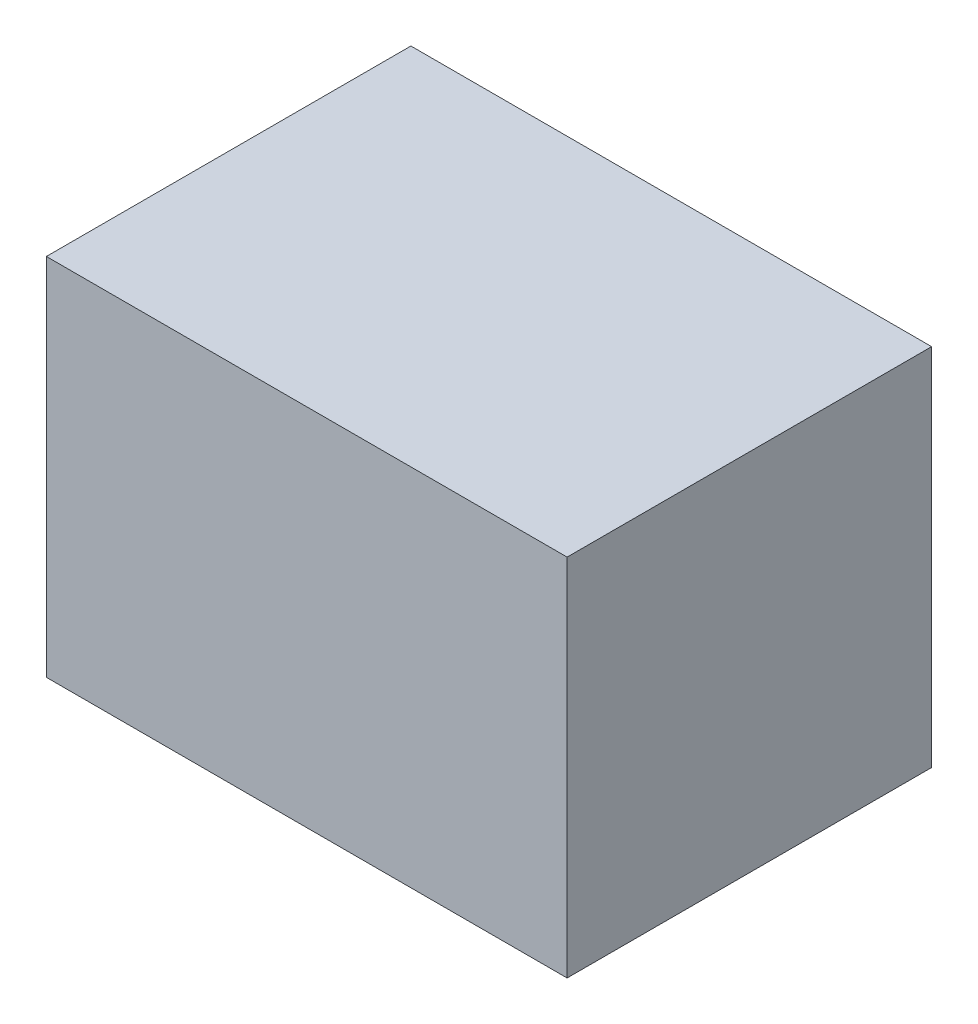
ISO-10303-21;
HEADER;
FILE_DESCRIPTION(('STEP AP214'),'2;1');
FILE_NAME('part.step','',(''),(''),'','','');
FILE_SCHEMA(('AUTOMOTIVE_DESIGN { 1 0 10303 214 1 1 1 1 }'));
ENDSEC;
DATA;
#1=APPLICATION_CONTEXT('core data for automotive mechanical design processes');
#2=APPLICATION_PROTOCOL_DEFINITION('international standard','automotive_design',2000,#1);
#3=PRODUCT_CONTEXT('',#1,'mechanical');
#4=PRODUCT('Part','Part','',(#3));
#5=PRODUCT_RELATED_PRODUCT_CATEGORY('part','',(#4));
#6=PRODUCT_DEFINITION_FORMATION('','',#4);
#7=PRODUCT_DEFINITION_CONTEXT('part definition',#1,'design');
#8=PRODUCT_DEFINITION('design','',#6,#7);
#9=PRODUCT_DEFINITION_SHAPE('','',#8);
#10=(LENGTH_UNIT() NAMED_UNIT(*) SI_UNIT(.MILLI.,.METRE.));
#11=(NAMED_UNIT(*) PLANE_ANGLE_UNIT() SI_UNIT($,.RADIAN.));
#12=(NAMED_UNIT(*) SI_UNIT($,.STERADIAN.) SOLID_ANGLE_UNIT());
#13=UNCERTAINTY_MEASURE_WITH_UNIT(LENGTH_MEASURE(1.E-05),#10,'distance_accuracy_value','');
#14=(GEOMETRIC_REPRESENTATION_CONTEXT(3) GLOBAL_UNCERTAINTY_ASSIGNED_CONTEXT((#13)) GLOBAL_UNIT_ASSIGNED_CONTEXT((#10,
#11,#12)) REPRESENTATION_CONTEXT('',''));
#15=CARTESIAN_POINT('',(0.,0.,0.));
#16=DIRECTION('',(0.,0.,1.));
#17=DIRECTION('',(1.,0.,0.));
#18=AXIS2_PLACEMENT_3D('',#15,#16,#17);
#19=CARTESIAN_POINT('',(-22.86,0.,0.));
#20=DIRECTION('',(0.,1.,0.));
#21=DIRECTION('',(1.,0.,0.));
#22=AXIS2_PLACEMENT_3D('',#19,#20,#21);
#23=PLANE('',#22);
#24=DIRECTION('',(0.,0.,1.));
#25=VECTOR('',#24,1.);
#26=CARTESIAN_POINT('',(-7.87,0.,0.749999999999982));
#27=LINE('',#26,#25);
#28=CARTESIAN_POINT('',(-7.87,0.,0.749999999999982));
#29=VERTEX_POINT('',#28);
#30=CARTESIAN_POINT('',(-7.87,0.,1.1));
#31=VERTEX_POINT('',#30);
#32=EDGE_CURVE('E79',#29,#31,#27,.T.);
#33=ORIENTED_EDGE('',*,*,#32,.T.);
#34=DIRECTION('',(1.,0.,0.));
#35=VECTOR('',#34,1.);
#36=CARTESIAN_POINT('',(-7.87,0.,1.1));
#37=LINE('',#36,#35);
#38=CARTESIAN_POINT('',(-7.37,0.,1.1));
#39=VERTEX_POINT('',#38);
#40=EDGE_CURVE('E28',#31,#39,#37,.T.);
#41=ORIENTED_EDGE('',*,*,#40,.T.);
#42=DIRECTION('',(0.,0.,1.));
#43=VECTOR('',#42,1.);
#44=CARTESIAN_POINT('',(-7.37,0.,0.749999999999982));
#45=LINE('',#44,#43);
#46=CARTESIAN_POINT('',(-7.37,0.,0.749999999999982));
#47=VERTEX_POINT('',#46);
#48=EDGE_CURVE('E100',#47,#39,#45,.T.);
#49=ORIENTED_EDGE('',*,*,#48,.F.);
#50=DIRECTION('',(1.,0.,0.));
#51=VECTOR('',#50,1.);
#52=CARTESIAN_POINT('',(-7.87,0.,0.749999999999982));
#53=LINE('',#52,#51);
#54=EDGE_CURVE('E83',#29,#47,#53,.T.);
#55=ORIENTED_EDGE('',*,*,#54,.F.);
#56=EDGE_LOOP('',(#33,#41,#49,#55));
#57=FACE_BOUND('',#56,.T.);
#58=ADVANCED_FACE('F17',(#57),#23,.T.);
#59=CARTESIAN_POINT('',(-22.86,-0.35,0.));
#60=DIRECTION('',(0.,1.,0.));
#61=DIRECTION('',(1.,0.,0.));
#62=AXIS2_PLACEMENT_3D('',#59,#60,#61);
#63=PLANE('',#62);
#64=DIRECTION('',(0.,0.,1.));
#65=VECTOR('',#64,1.);
#66=CARTESIAN_POINT('',(-7.87,-0.35,0.749999999999982));
#67=LINE('',#66,#65);
#68=CARTESIAN_POINT('',(-7.87,-0.35,0.749999999999982));
#69=VERTEX_POINT('',#68);
#70=CARTESIAN_POINT('',(-7.87,-0.35,1.1));
#71=VERTEX_POINT('',#70);
#72=EDGE_CURVE('E81',#69,#71,#67,.T.);
#73=ORIENTED_EDGE('',*,*,#72,.F.);
#74=DIRECTION('',(1.,0.,0.));
#75=VECTOR('',#74,1.);
#76=CARTESIAN_POINT('',(-7.87,-0.35,0.749999999999982));
#77=LINE('',#76,#75);
#78=CARTESIAN_POINT('',(-7.37,-0.35,0.749999999999982));
#79=VERTEX_POINT('',#78);
#80=EDGE_CURVE('E97',#69,#79,#77,.T.);
#81=ORIENTED_EDGE('',*,*,#80,.T.);
#82=DIRECTION('',(0.,0.,1.));
#83=VECTOR('',#82,1.);
#84=CARTESIAN_POINT('',(-7.37,-0.35,0.749999999999982));
#85=LINE('',#84,#83);
#86=CARTESIAN_POINT('',(-7.37,-0.35,1.1));
#87=VERTEX_POINT('',#86);
#88=EDGE_CURVE('E73',#79,#87,#85,.T.);
#89=ORIENTED_EDGE('',*,*,#88,.T.);
#90=DIRECTION('',(1.,0.,0.));
#91=VECTOR('',#90,1.);
#92=CARTESIAN_POINT('',(-7.87,-0.35,1.1));
#93=LINE('',#92,#91);
#94=EDGE_CURVE('E11',#71,#87,#93,.T.);
#95=ORIENTED_EDGE('',*,*,#94,.F.);
#96=EDGE_LOOP('',(#73,#81,#89,#95));
#97=FACE_BOUND('',#96,.T.);
#98=ADVANCED_FACE('F19',(#97),#63,.F.);
#99=CARTESIAN_POINT('',(-7.87,-0.35,1.1));
#100=DIRECTION('',(0.,0.,1.));
#101=DIRECTION('',(1.,0.,0.));
#102=AXIS2_PLACEMENT_3D('',#99,#100,#101);
#103=PLANE('',#102);
#104=ORIENTED_EDGE('',*,*,#40,.F.);
#105=DIRECTION('',(0.,1.,0.));
#106=VECTOR('',#105,1.);
#107=CARTESIAN_POINT('',(-7.87,-0.35,1.1));
#108=LINE('',#107,#106);
#109=EDGE_CURVE('E66',#71,#31,#108,.T.);
#110=ORIENTED_EDGE('',*,*,#109,.F.);
#111=ORIENTED_EDGE('',*,*,#94,.T.);
#112=DIRECTION('',(0.,1.,0.));
#113=VECTOR('',#112,1.);
#114=CARTESIAN_POINT('',(-7.37,-0.35,1.1));
#115=LINE('',#114,#113);
#116=EDGE_CURVE('E21',#87,#39,#115,.T.);
#117=ORIENTED_EDGE('',*,*,#116,.T.);
#118=EDGE_LOOP('',(#104,#110,#111,#117));
#119=FACE_BOUND('',#118,.T.);
#120=ADVANCED_FACE('F65',(#119),#103,.T.);
#121=CARTESIAN_POINT('',(-7.37,-0.35,0.749999999999982));
#122=DIRECTION('',(-1.,0.,0.));
#123=DIRECTION('',(0.,0.,1.));
#124=AXIS2_PLACEMENT_3D('',#121,#122,#123);
#125=PLANE('',#124);
#126=ORIENTED_EDGE('',*,*,#48,.T.);
#127=ORIENTED_EDGE('',*,*,#116,.F.);
#128=ORIENTED_EDGE('',*,*,#88,.F.);
#129=DIRECTION('',(0.,1.,0.));
#130=VECTOR('',#129,1.);
#131=CARTESIAN_POINT('',(-7.37,-0.35,0.749999999999982));
#132=LINE('',#131,#130);
#133=EDGE_CURVE('E101',#79,#47,#132,.T.);
#134=ORIENTED_EDGE('',*,*,#133,.T.);
#135=EDGE_LOOP('',(#126,#127,#128,#134));
#136=FACE_BOUND('',#135,.T.);
#137=ADVANCED_FACE('F116',(#136),#125,.F.);
#138=CARTESIAN_POINT('',(-7.87,-0.35,0.749999999999982));
#139=DIRECTION('',(0.,0.,1.));
#140=DIRECTION('',(1.,0.,0.));
#141=AXIS2_PLACEMENT_3D('',#138,#139,#140);
#142=PLANE('',#141);
#143=ORIENTED_EDGE('',*,*,#54,.T.);
#144=ORIENTED_EDGE('',*,*,#133,.F.);
#145=ORIENTED_EDGE('',*,*,#80,.F.);
#146=DIRECTION('',(0.,1.,0.));
#147=VECTOR('',#146,1.);
#148=CARTESIAN_POINT('',(-7.87,-0.35,0.749999999999982));
#149=LINE('',#148,#147);
#150=EDGE_CURVE('E88',#69,#29,#149,.T.);
#151=ORIENTED_EDGE('',*,*,#150,.T.);
#152=EDGE_LOOP('',(#143,#144,#145,#151));
#153=FACE_BOUND('',#152,.T.);
#154=ADVANCED_FACE('F118',(#153),#142,.F.);
#155=CARTESIAN_POINT('',(-7.87,-0.35,0.749999999999982));
#156=DIRECTION('',(-1.,0.,0.));
#157=DIRECTION('',(0.,0.,1.));
#158=AXIS2_PLACEMENT_3D('',#155,#156,#157);
#159=PLANE('',#158);
#160=ORIENTED_EDGE('',*,*,#32,.F.);
#161=ORIENTED_EDGE('',*,*,#150,.F.);
#162=ORIENTED_EDGE('',*,*,#72,.T.);
#163=ORIENTED_EDGE('',*,*,#109,.T.);
#164=EDGE_LOOP('',(#160,#161,#162,#163));
#165=FACE_BOUND('',#164,.T.);
#166=ADVANCED_FACE('F77',(#165),#159,.T.);
#167=CLOSED_SHELL('',(#58,#98,#120,#137,#154,#166));
#168=MANIFOLD_SOLID_BREP('B1',#167);
#169=ADVANCED_BREP_SHAPE_REPRESENTATION('',(#18,#168),#14);
#170=SHAPE_DEFINITION_REPRESENTATION(#9,#169);
ENDSEC;
END-ISO-10303-21;
